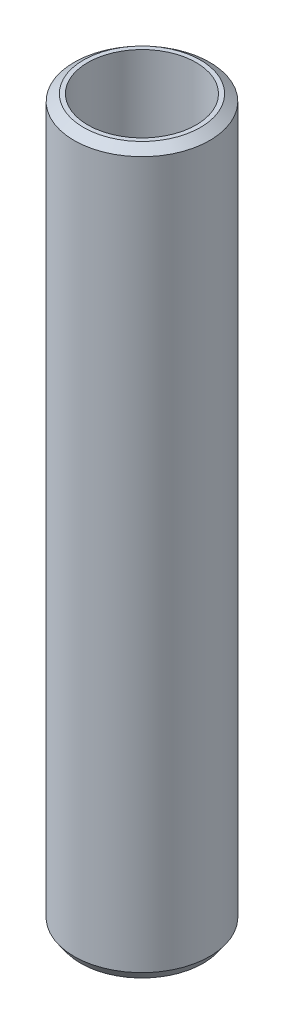
ISO-10303-21;
HEADER;
FILE_DESCRIPTION(('STEP AP214'),'2;1');
FILE_NAME('part.step','',(''),(''),'','','');
FILE_SCHEMA(('AUTOMOTIVE_DESIGN { 1 0 10303 214 1 1 1 1 }'));
ENDSEC;
DATA;
#1=APPLICATION_CONTEXT('core data for automotive mechanical design processes');
#2=APPLICATION_PROTOCOL_DEFINITION('international standard','automotive_design',2000,#1);
#3=PRODUCT_CONTEXT('',#1,'mechanical');
#4=PRODUCT('Part','Part','',(#3));
#5=PRODUCT_RELATED_PRODUCT_CATEGORY('part','',(#4));
#6=PRODUCT_DEFINITION_FORMATION('','',#4);
#7=PRODUCT_DEFINITION_CONTEXT('part definition',#1,'design');
#8=PRODUCT_DEFINITION('design','',#6,#7);
#9=PRODUCT_DEFINITION_SHAPE('','',#8);
#10=(LENGTH_UNIT() NAMED_UNIT(*) SI_UNIT(.MILLI.,.METRE.));
#11=(NAMED_UNIT(*) PLANE_ANGLE_UNIT() SI_UNIT($,.RADIAN.));
#12=(NAMED_UNIT(*) SI_UNIT($,.STERADIAN.) SOLID_ANGLE_UNIT());
#13=UNCERTAINTY_MEASURE_WITH_UNIT(LENGTH_MEASURE(1.E-05),#10,'distance_accuracy_value','');
#14=(GEOMETRIC_REPRESENTATION_CONTEXT(3) GLOBAL_UNCERTAINTY_ASSIGNED_CONTEXT((#13)) GLOBAL_UNIT_ASSIGNED_CONTEXT((#10,
#11,#12)) REPRESENTATION_CONTEXT('',''));
#15=CARTESIAN_POINT('',(0.,0.,0.));
#16=DIRECTION('',(0.,0.,1.));
#17=DIRECTION('',(1.,0.,0.));
#18=AXIS2_PLACEMENT_3D('',#15,#16,#17);
#19=CARTESIAN_POINT('',(0.,532.97779377403,0.));
#20=DIRECTION('',(0.,-1.,0.));
#21=DIRECTION('',(0.,0.,-1.));
#22=AXIS2_PLACEMENT_3D('',#19,#20,#21);
#23=CYLINDRICAL_SURFACE('',#22,50.);
#24=CARTESIAN_POINT('',(0.,528.094805315195,0.));
#25=DIRECTION('',(0.,1.,0.));
#26=DIRECTION('',(0.,0.,1.));
#27=AXIS2_PLACEMENT_3D('',#24,#25,#26);
#28=CIRCLE('',#27,50.);
#29=CARTESIAN_POINT('',(0.,528.094805315195,50.));
#30=VERTEX_POINT('',#29);
#31=EDGE_CURVE('E50',#30,#30,#28,.F.);
#32=ORIENTED_EDGE('',*,*,#31,.T.);
#33=EDGE_LOOP('',(#32));
#34=FACE_BOUND('',#33,.T.);
#35=CARTESIAN_POINT('',(0.,6.87558453994064,0.));
#36=DIRECTION('',(0.,1.,0.));
#37=DIRECTION('',(0.,0.,1.));
#38=AXIS2_PLACEMENT_3D('',#35,#36,#37);
#39=CIRCLE('',#38,50.);
#40=CARTESIAN_POINT('',(0.,6.87558453994064,50.));
#41=VERTEX_POINT('',#40);
#42=EDGE_CURVE('E51',#41,#41,#39,.T.);
#43=ORIENTED_EDGE('',*,*,#42,.T.);
#44=EDGE_LOOP('',(#43));
#45=FACE_BOUND('',#44,.T.);
#46=ADVANCED_FACE('F39',(#34,#45),#23,.T.);
#47=CARTESIAN_POINT('',(0.,532.97779377403,0.));
#48=DIRECTION('',(0.,1.,0.));
#49=DIRECTION('',(0.,0.,1.));
#50=AXIS2_PLACEMENT_3D('',#47,#48,#49);
#51=PLANE('',#50);
#52=CARTESIAN_POINT('',(0.,532.97779377403,0.));
#53=DIRECTION('',(0.,1.,0.));
#54=DIRECTION('',(0.,0.,1.));
#55=AXIS2_PLACEMENT_3D('',#52,#53,#54);
#56=CIRCLE('',#55,43.1244154600592);
#57=CARTESIAN_POINT('',(0.,532.97779377403,43.1244154600592));
#58=VERTEX_POINT('',#57);
#59=EDGE_CURVE('E54',#58,#58,#56,.T.);
#60=ORIENTED_EDGE('',*,*,#59,.T.);
#61=EDGE_LOOP('',(#60));
#62=FACE_BOUND('',#61,.T.);
#63=CARTESIAN_POINT('',(0.,532.97779377403,0.));
#64=DIRECTION('',(0.,1.,0.));
#65=DIRECTION('',(0.,0.,1.));
#66=AXIS2_PLACEMENT_3D('',#63,#64,#65);
#67=CIRCLE('',#66,39.9431560886761);
#68=CARTESIAN_POINT('',(0.,532.97779377403,39.9431560886761));
#69=VERTEX_POINT('',#68);
#70=EDGE_CURVE('E58',#69,#69,#67,.T.);
#71=ORIENTED_EDGE('',*,*,#70,.F.);
#72=EDGE_LOOP('',(#71));
#73=FACE_BOUND('',#72,.T.);
#74=ADVANCED_FACE('F69',(#62,#73),#51,.T.);
#75=CARTESIAN_POINT('',(0.,0.,0.));
#76=DIRECTION('',(0.,1.,0.));
#77=DIRECTION('',(0.,0.,1.));
#78=AXIS2_PLACEMENT_3D('',#75,#76,#77);
#79=PLANE('',#78);
#80=CARTESIAN_POINT('',(0.,0.,0.));
#81=DIRECTION('',(0.,1.,0.));
#82=DIRECTION('',(0.,0.,1.));
#83=AXIS2_PLACEMENT_3D('',#80,#81,#82);
#84=CIRCLE('',#83,45.1170115411655);
#85=CARTESIAN_POINT('',(0.,0.,45.1170115411655));
#86=VERTEX_POINT('',#85);
#87=EDGE_CURVE('E10',#86,#86,#84,.F.);
#88=ORIENTED_EDGE('',*,*,#87,.T.);
#89=EDGE_LOOP('',(#88));
#90=FACE_BOUND('',#89,.T.);
#91=CARTESIAN_POINT('',(0.,0.,0.));
#92=DIRECTION('',(0.,1.,0.));
#93=DIRECTION('',(0.,0.,1.));
#94=AXIS2_PLACEMENT_3D('',#91,#92,#93);
#95=CIRCLE('',#94,39.9431560886761);
#96=CARTESIAN_POINT('',(0.,0.,39.9431560886761));
#97=VERTEX_POINT('',#96);
#98=EDGE_CURVE('E63',#97,#97,#95,.T.);
#99=ORIENTED_EDGE('',*,*,#98,.T.);
#100=EDGE_LOOP('',(#99));
#101=FACE_BOUND('',#100,.T.);
#102=ADVANCED_FACE('F75',(#90,#101),#79,.F.);
#103=CARTESIAN_POINT('',(0.,532.97779377403,0.));
#104=DIRECTION('',(0.,-1.,0.));
#105=DIRECTION('',(0.,0.,-1.));
#106=AXIS2_PLACEMENT_3D('',#103,#104,#105);
#107=CYLINDRICAL_SURFACE('',#106,39.9431560886761);
#108=ORIENTED_EDGE('',*,*,#70,.T.);
#109=EDGE_LOOP('',(#108));
#110=FACE_BOUND('',#109,.T.);
#111=ORIENTED_EDGE('',*,*,#98,.F.);
#112=EDGE_LOOP('',(#111));
#113=FACE_BOUND('',#112,.T.);
#114=ADVANCED_FACE('F70',(#110,#113),#107,.F.);
#115=CARTESIAN_POINT('',(0.,532.97779377403,0.));
#116=DIRECTION('',(0.,-1.,0.));
#117=DIRECTION('',(0.,0.,-1.));
#118=AXIS2_PLACEMENT_3D('',#115,#116,#117);
#119=CONICAL_SURFACE('',#118,43.1244154600592,0.95326247423527);
#120=ORIENTED_EDGE('',*,*,#31,.F.);
#121=EDGE_LOOP('',(#120));
#122=FACE_BOUND('',#121,.T.);
#123=ORIENTED_EDGE('',*,*,#59,.F.);
#124=EDGE_LOOP('',(#123));
#125=FACE_BOUND('',#124,.T.);
#126=ADVANCED_FACE('F81',(#122,#125),#119,.T.);
#127=CARTESIAN_POINT('',(0.,6.87558453994064,0.));
#128=DIRECTION('',(0.,1.,0.));
#129=DIRECTION('',(0.,0.,1.));
#130=AXIS2_PLACEMENT_3D('',#127,#128,#129);
#131=CONICAL_SURFACE('',#130,50.,0.617533852559635);
#132=ORIENTED_EDGE('',*,*,#87,.F.);
#133=EDGE_LOOP('',(#132));
#134=FACE_BOUND('',#133,.T.);
#135=ORIENTED_EDGE('',*,*,#42,.F.);
#136=EDGE_LOOP('',(#135));
#137=FACE_BOUND('',#136,.T.);
#138=ADVANCED_FACE('F45',(#134,#137),#131,.T.);
#139=CLOSED_SHELL('',(#46,#74,#102,#114,#126,#138));
#140=MANIFOLD_SOLID_BREP('B2',#139);
#141=ADVANCED_BREP_SHAPE_REPRESENTATION('',(#18,#140),#14);
#142=SHAPE_DEFINITION_REPRESENTATION(#9,#141);
ENDSEC;
END-ISO-10303-21;
